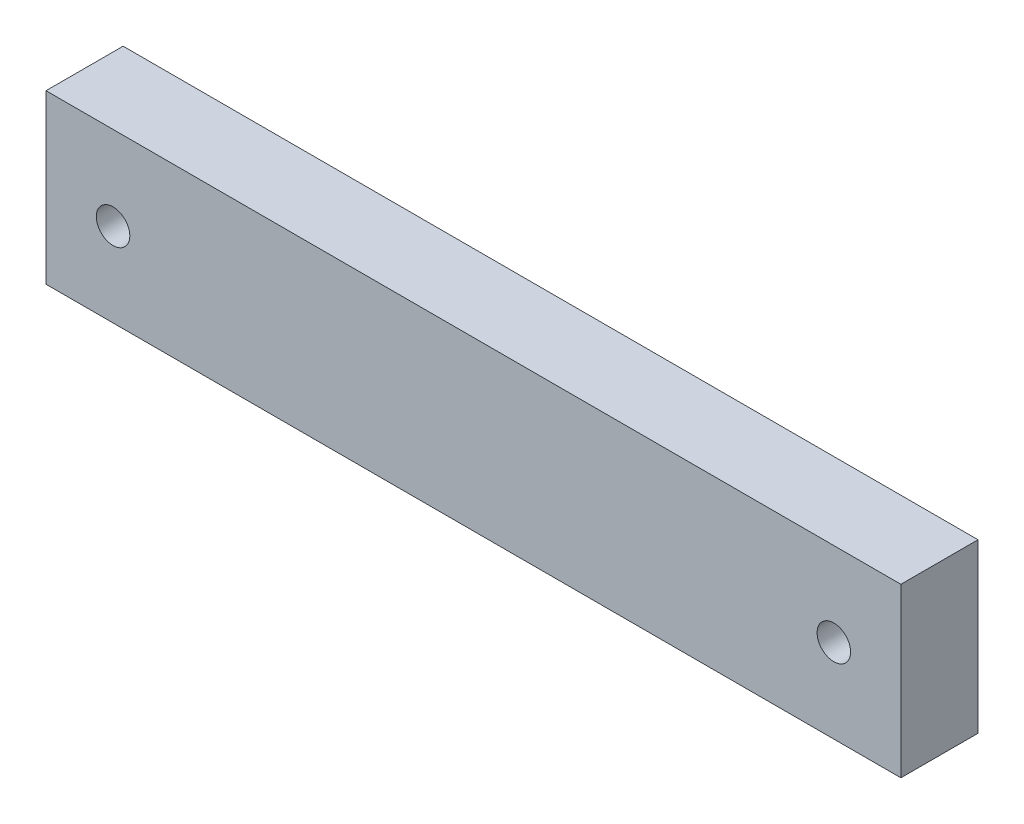
ISO-10303-21;
HEADER;
FILE_DESCRIPTION(('STEP AP214'),'2;1');
FILE_NAME('part.step','',(''),(''),'','','');
FILE_SCHEMA(('AUTOMOTIVE_DESIGN { 1 0 10303 214 1 1 1 1 }'));
ENDSEC;
DATA;
#1=APPLICATION_CONTEXT('core data for automotive mechanical design processes');
#2=APPLICATION_PROTOCOL_DEFINITION('international standard','automotive_design',2000,#1);
#3=PRODUCT_CONTEXT('',#1,'mechanical');
#4=PRODUCT('Part','Part','',(#3));
#5=PRODUCT_RELATED_PRODUCT_CATEGORY('part','',(#4));
#6=PRODUCT_DEFINITION_FORMATION('','',#4);
#7=PRODUCT_DEFINITION_CONTEXT('part definition',#1,'design');
#8=PRODUCT_DEFINITION('design','',#6,#7);
#9=PRODUCT_DEFINITION_SHAPE('','',#8);
#10=(LENGTH_UNIT() NAMED_UNIT(*) SI_UNIT(.MILLI.,.METRE.));
#11=(NAMED_UNIT(*) PLANE_ANGLE_UNIT() SI_UNIT($,.RADIAN.));
#12=(NAMED_UNIT(*) SI_UNIT($,.STERADIAN.) SOLID_ANGLE_UNIT());
#13=UNCERTAINTY_MEASURE_WITH_UNIT(LENGTH_MEASURE(1.E-05),#10,'distance_accuracy_value','');
#14=(GEOMETRIC_REPRESENTATION_CONTEXT(3) GLOBAL_UNCERTAINTY_ASSIGNED_CONTEXT((#13)) GLOBAL_UNIT_ASSIGNED_CONTEXT((#10,
#11,#12)) REPRESENTATION_CONTEXT('',''));
#15=CARTESIAN_POINT('',(0.,0.,0.));
#16=DIRECTION('',(0.,0.,1.));
#17=DIRECTION('',(1.,0.,0.));
#18=AXIS2_PLACEMENT_3D('',#15,#16,#17);
#19=CARTESIAN_POINT('',(0.,0.,23.));
#20=DIRECTION('',(0.,0.,1.));
#21=DIRECTION('',(1.,0.,0.));
#22=AXIS2_PLACEMENT_3D('',#19,#20,#21);
#23=PLANE('',#22);
#24=CARTESIAN_POINT('',(-107.5,0.,23.));
#25=DIRECTION('',(0.,0.,1.));
#26=DIRECTION('',(1.,0.,0.));
#27=AXIS2_PLACEMENT_3D('',#24,#25,#26);
#28=CIRCLE('',#27,4.99999999999999);
#29=CARTESIAN_POINT('',(-102.5,0.,23.));
#30=VERTEX_POINT('',#29);
#31=EDGE_CURVE('E99',#30,#30,#28,.T.);
#32=ORIENTED_EDGE('',*,*,#31,.F.);
#33=EDGE_LOOP('',(#32));
#34=FACE_BOUND('',#33,.T.);
#35=DIRECTION('',(0.,1.,0.));
#36=VECTOR('',#35,1.);
#37=CARTESIAN_POINT('',(127.5,25.,23.));
#38=LINE('',#37,#36);
#39=CARTESIAN_POINT('',(127.5,-25.,23.));
#40=VERTEX_POINT('',#39);
#41=CARTESIAN_POINT('',(127.5,25.,23.));
#42=VERTEX_POINT('',#41);
#43=EDGE_CURVE('E84',#40,#42,#38,.T.);
#44=ORIENTED_EDGE('',*,*,#43,.T.);
#45=DIRECTION('',(-1.,0.,0.));
#46=VECTOR('',#45,1.);
#47=CARTESIAN_POINT('',(-127.5,25.,23.));
#48=LINE('',#47,#46);
#49=CARTESIAN_POINT('',(-127.5,25.,23.));
#50=VERTEX_POINT('',#49);
#51=EDGE_CURVE('E79',#42,#50,#48,.T.);
#52=ORIENTED_EDGE('',*,*,#51,.T.);
#53=DIRECTION('',(0.,-1.,0.));
#54=VECTOR('',#53,1.);
#55=CARTESIAN_POINT('',(-127.5,25.,23.));
#56=LINE('',#55,#54);
#57=CARTESIAN_POINT('',(-127.5,-25.,23.));
#58=VERTEX_POINT('',#57);
#59=EDGE_CURVE('E82',#50,#58,#56,.T.);
#60=ORIENTED_EDGE('',*,*,#59,.T.);
#61=DIRECTION('',(1.,0.,0.));
#62=VECTOR('',#61,1.);
#63=CARTESIAN_POINT('',(-127.5,-25.,23.));
#64=LINE('',#63,#62);
#65=EDGE_CURVE('E49',#58,#40,#64,.T.);
#66=ORIENTED_EDGE('',*,*,#65,.T.);
#67=EDGE_LOOP('',(#44,#52,#60,#66));
#68=FACE_BOUND('',#67,.T.);
#69=CARTESIAN_POINT('',(107.5,0.,23.));
#70=DIRECTION('',(0.,0.,1.));
#71=DIRECTION('',(1.,0.,0.));
#72=AXIS2_PLACEMENT_3D('',#69,#70,#71);
#73=CIRCLE('',#72,4.99999999999999);
#74=CARTESIAN_POINT('',(112.5,0.,23.));
#75=VERTEX_POINT('',#74);
#76=EDGE_CURVE('E114',#75,#75,#73,.T.);
#77=ORIENTED_EDGE('',*,*,#76,.F.);
#78=EDGE_LOOP('',(#77));
#79=FACE_BOUND('',#78,.T.);
#80=ADVANCED_FACE('F32',(#34,#68,#79),#23,.T.);
#81=CARTESIAN_POINT('',(0.,0.,0.));
#82=DIRECTION('',(0.,0.,1.));
#83=DIRECTION('',(1.,0.,0.));
#84=AXIS2_PLACEMENT_3D('',#81,#82,#83);
#85=PLANE('',#84);
#86=CARTESIAN_POINT('',(-107.5,0.,0.));
#87=DIRECTION('',(0.,0.,1.));
#88=DIRECTION('',(1.,0.,0.));
#89=AXIS2_PLACEMENT_3D('',#86,#87,#88);
#90=CIRCLE('',#89,4.99999999999999);
#91=CARTESIAN_POINT('',(-102.5,0.,0.));
#92=VERTEX_POINT('',#91);
#93=EDGE_CURVE('E111',#92,#92,#90,.T.);
#94=ORIENTED_EDGE('',*,*,#93,.T.);
#95=EDGE_LOOP('',(#94));
#96=FACE_BOUND('',#95,.T.);
#97=DIRECTION('',(0.,1.,0.));
#98=VECTOR('',#97,1.);
#99=CARTESIAN_POINT('',(127.5,25.,0.));
#100=LINE('',#99,#98);
#101=CARTESIAN_POINT('',(127.5,-25.,0.));
#102=VERTEX_POINT('',#101);
#103=CARTESIAN_POINT('',(127.5,25.,0.));
#104=VERTEX_POINT('',#103);
#105=EDGE_CURVE('E96',#102,#104,#100,.T.);
#106=ORIENTED_EDGE('',*,*,#105,.F.);
#107=DIRECTION('',(1.,0.,0.));
#108=VECTOR('',#107,1.);
#109=CARTESIAN_POINT('',(-127.5,-25.,0.));
#110=LINE('',#109,#108);
#111=CARTESIAN_POINT('',(-127.5,-25.,0.));
#112=VERTEX_POINT('',#111);
#113=EDGE_CURVE('E72',#112,#102,#110,.T.);
#114=ORIENTED_EDGE('',*,*,#113,.F.);
#115=DIRECTION('',(0.,-1.,0.));
#116=VECTOR('',#115,1.);
#117=CARTESIAN_POINT('',(-127.5,25.,0.));
#118=LINE('',#117,#116);
#119=CARTESIAN_POINT('',(-127.5,25.,0.));
#120=VERTEX_POINT('',#119);
#121=EDGE_CURVE('E66',#120,#112,#118,.T.);
#122=ORIENTED_EDGE('',*,*,#121,.F.);
#123=DIRECTION('',(-1.,0.,0.));
#124=VECTOR('',#123,1.);
#125=CARTESIAN_POINT('',(-127.5,25.,0.));
#126=LINE('',#125,#124);
#127=EDGE_CURVE('E88',#104,#120,#126,.T.);
#128=ORIENTED_EDGE('',*,*,#127,.F.);
#129=EDGE_LOOP('',(#106,#114,#122,#128));
#130=FACE_BOUND('',#129,.T.);
#131=CARTESIAN_POINT('',(107.5,0.,0.));
#132=DIRECTION('',(0.,0.,1.));
#133=DIRECTION('',(1.,0.,0.));
#134=AXIS2_PLACEMENT_3D('',#131,#132,#133);
#135=CIRCLE('',#134,4.99999999999999);
#136=CARTESIAN_POINT('',(112.5,0.,0.));
#137=VERTEX_POINT('',#136);
#138=EDGE_CURVE('E117',#137,#137,#135,.T.);
#139=ORIENTED_EDGE('',*,*,#138,.T.);
#140=EDGE_LOOP('',(#139));
#141=FACE_BOUND('',#140,.T.);
#142=ADVANCED_FACE('F107',(#96,#130,#141),#85,.F.);
#143=CARTESIAN_POINT('',(127.5,25.,23.));
#144=DIRECTION('',(-1.,0.,0.));
#145=DIRECTION('',(0.,0.,1.));
#146=AXIS2_PLACEMENT_3D('',#143,#144,#145);
#147=PLANE('',#146);
#148=ORIENTED_EDGE('',*,*,#105,.T.);
#149=DIRECTION('',(0.,0.,-1.));
#150=VECTOR('',#149,1.);
#151=CARTESIAN_POINT('',(127.5,25.,23.));
#152=LINE('',#151,#150);
#153=EDGE_CURVE('E11',#42,#104,#152,.T.);
#154=ORIENTED_EDGE('',*,*,#153,.F.);
#155=ORIENTED_EDGE('',*,*,#43,.F.);
#156=DIRECTION('',(0.,0.,-1.));
#157=VECTOR('',#156,1.);
#158=CARTESIAN_POINT('',(127.5,-25.,23.));
#159=LINE('',#158,#157);
#160=EDGE_CURVE('E92',#40,#102,#159,.T.);
#161=ORIENTED_EDGE('',*,*,#160,.T.);
#162=EDGE_LOOP('',(#148,#154,#155,#161));
#163=FACE_BOUND('',#162,.T.);
#164=ADVANCED_FACE('F34',(#163),#147,.F.);
#165=CARTESIAN_POINT('',(-127.5,25.,23.));
#166=DIRECTION('',(0.,-1.,0.));
#167=DIRECTION('',(0.,0.,-1.));
#168=AXIS2_PLACEMENT_3D('',#165,#166,#167);
#169=PLANE('',#168);
#170=ORIENTED_EDGE('',*,*,#127,.T.);
#171=DIRECTION('',(0.,0.,-1.));
#172=VECTOR('',#171,1.);
#173=CARTESIAN_POINT('',(-127.5,25.,23.));
#174=LINE('',#173,#172);
#175=EDGE_CURVE('E41',#50,#120,#174,.T.);
#176=ORIENTED_EDGE('',*,*,#175,.F.);
#177=ORIENTED_EDGE('',*,*,#51,.F.);
#178=ORIENTED_EDGE('',*,*,#153,.T.);
#179=EDGE_LOOP('',(#170,#176,#177,#178));
#180=FACE_BOUND('',#179,.T.);
#181=ADVANCED_FACE('F87',(#180),#169,.F.);
#182=CARTESIAN_POINT('',(-127.5,25.,23.));
#183=DIRECTION('',(1.,0.,0.));
#184=DIRECTION('',(0.,0.,-1.));
#185=AXIS2_PLACEMENT_3D('',#182,#183,#184);
#186=PLANE('',#185);
#187=ORIENTED_EDGE('',*,*,#121,.T.);
#188=DIRECTION('',(0.,0.,-1.));
#189=VECTOR('',#188,1.);
#190=CARTESIAN_POINT('',(-127.5,-25.,23.));
#191=LINE('',#190,#189);
#192=EDGE_CURVE('E89',#58,#112,#191,.T.);
#193=ORIENTED_EDGE('',*,*,#192,.F.);
#194=ORIENTED_EDGE('',*,*,#59,.F.);
#195=ORIENTED_EDGE('',*,*,#175,.T.);
#196=EDGE_LOOP('',(#187,#193,#194,#195));
#197=FACE_BOUND('',#196,.T.);
#198=ADVANCED_FACE('F90',(#197),#186,.F.);
#199=CARTESIAN_POINT('',(-127.5,-25.,23.));
#200=DIRECTION('',(0.,1.,0.));
#201=DIRECTION('',(0.,0.,1.));
#202=AXIS2_PLACEMENT_3D('',#199,#200,#201);
#203=PLANE('',#202);
#204=ORIENTED_EDGE('',*,*,#113,.T.);
#205=ORIENTED_EDGE('',*,*,#160,.F.);
#206=ORIENTED_EDGE('',*,*,#65,.F.);
#207=ORIENTED_EDGE('',*,*,#192,.T.);
#208=EDGE_LOOP('',(#204,#205,#206,#207));
#209=FACE_BOUND('',#208,.T.);
#210=ADVANCED_FACE('F104',(#209),#203,.F.);
#211=CARTESIAN_POINT('',(-107.5,0.,23.));
#212=DIRECTION('',(0.,0.,-1.));
#213=DIRECTION('',(-1.,0.,0.));
#214=AXIS2_PLACEMENT_3D('',#211,#212,#213);
#215=CYLINDRICAL_SURFACE('',#214,4.99999999999999);
#216=ORIENTED_EDGE('',*,*,#31,.T.);
#217=EDGE_LOOP('',(#216));
#218=FACE_BOUND('',#217,.T.);
#219=ORIENTED_EDGE('',*,*,#93,.F.);
#220=EDGE_LOOP('',(#219));
#221=FACE_BOUND('',#220,.T.);
#222=ADVANCED_FACE('F135',(#218,#221),#215,.F.);
#223=CARTESIAN_POINT('',(107.5,0.,23.));
#224=DIRECTION('',(0.,0.,-1.));
#225=DIRECTION('',(-1.,0.,0.));
#226=AXIS2_PLACEMENT_3D('',#223,#224,#225);
#227=CYLINDRICAL_SURFACE('',#226,4.99999999999999);
#228=ORIENTED_EDGE('',*,*,#76,.T.);
#229=EDGE_LOOP('',(#228));
#230=FACE_BOUND('',#229,.T.);
#231=ORIENTED_EDGE('',*,*,#138,.F.);
#232=EDGE_LOOP('',(#231));
#233=FACE_BOUND('',#232,.T.);
#234=ADVANCED_FACE('F123',(#230,#233),#227,.F.);
#235=CLOSED_SHELL('',(#80,#142,#164,#181,#198,#210,#222,#234));
#236=MANIFOLD_SOLID_BREP('B2',#235);
#237=ADVANCED_BREP_SHAPE_REPRESENTATION('',(#18,#236),#14);
#238=SHAPE_DEFINITION_REPRESENTATION(#9,#237);
ENDSEC;
END-ISO-10303-21;
